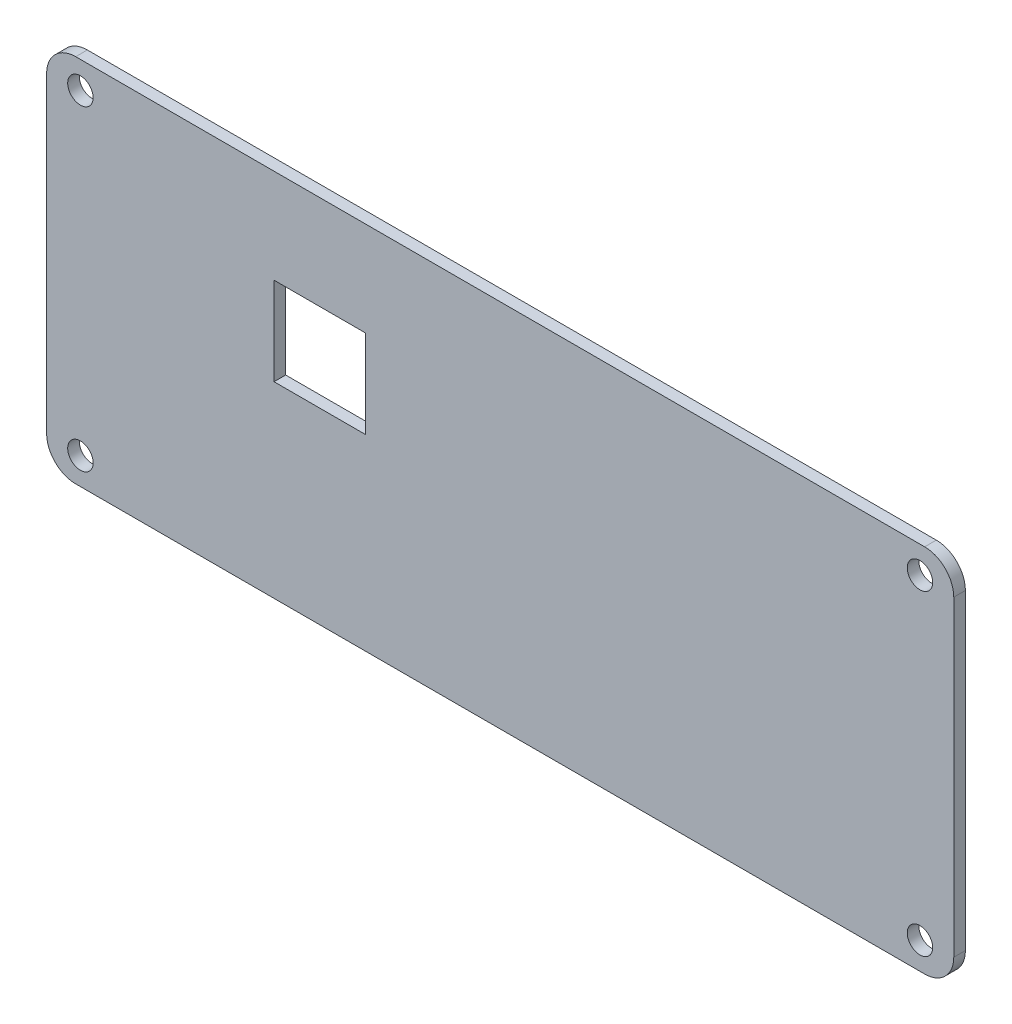
ISO-10303-21;
HEADER;
FILE_DESCRIPTION(('STEP AP214'),'2;1');
FILE_NAME('part.step','',(''),(''),'','','');
FILE_SCHEMA(('AUTOMOTIVE_DESIGN { 1 0 10303 214 1 1 1 1 }'));
ENDSEC;
DATA;
#1=APPLICATION_CONTEXT('core data for automotive mechanical design processes');
#2=APPLICATION_PROTOCOL_DEFINITION('international standard','automotive_design',2000,#1);
#3=PRODUCT_CONTEXT('',#1,'mechanical');
#4=PRODUCT('Part','Part','',(#3));
#5=PRODUCT_RELATED_PRODUCT_CATEGORY('part','',(#4));
#6=PRODUCT_DEFINITION_FORMATION('','',#4);
#7=PRODUCT_DEFINITION_CONTEXT('part definition',#1,'design');
#8=PRODUCT_DEFINITION('design','',#6,#7);
#9=PRODUCT_DEFINITION_SHAPE('','',#8);
#10=(LENGTH_UNIT() NAMED_UNIT(*) SI_UNIT(.MILLI.,.METRE.));
#11=(NAMED_UNIT(*) PLANE_ANGLE_UNIT() SI_UNIT($,.RADIAN.));
#12=(NAMED_UNIT(*) SI_UNIT($,.STERADIAN.) SOLID_ANGLE_UNIT());
#13=UNCERTAINTY_MEASURE_WITH_UNIT(LENGTH_MEASURE(1.E-05),#10,'distance_accuracy_value','');
#14=(GEOMETRIC_REPRESENTATION_CONTEXT(3) GLOBAL_UNCERTAINTY_ASSIGNED_CONTEXT((#13)) GLOBAL_UNIT_ASSIGNED_CONTEXT((#10,
#11,#12)) REPRESENTATION_CONTEXT('',''));
#15=CARTESIAN_POINT('',(0.,0.,0.));
#16=DIRECTION('',(0.,0.,1.));
#17=DIRECTION('',(1.,0.,0.));
#18=AXIS2_PLACEMENT_3D('',#15,#16,#17);
#19=CARTESIAN_POINT('',(4.65,-3.7,0.));
#20=DIRECTION('',(0.,0.,-1.));
#21=DIRECTION('',(1.,0.,0.));
#22=AXIS2_PLACEMENT_3D('',#19,#20,#21);
#23=CYLINDRICAL_SURFACE('',#22,1.75);
#24=CARTESIAN_POINT('',(4.65,-3.7,0.));
#25=DIRECTION('',(0.,0.,1.));
#26=DIRECTION('',(1.,0.,0.));
#27=AXIS2_PLACEMENT_3D('',#24,#25,#26);
#28=CIRCLE('',#27,1.75);
#29=CARTESIAN_POINT('',(6.4,-3.7,0.));
#30=VERTEX_POINT('',#29);
#31=EDGE_CURVE('E188',#30,#30,#28,.T.);
#32=ORIENTED_EDGE('',*,*,#31,.F.);
#33=DIRECTION('',(0.,0.,1.));
#34=VECTOR('',#33,1.);
#35=CARTESIAN_POINT('',(6.4,-3.7,0.));
#36=LINE('',#35,#34);
#37=CARTESIAN_POINT('',(6.4,-3.7,1.6));
#38=VERTEX_POINT('',#37);
#39=EDGE_CURVE('E10',#30,#38,#36,.T.);
#40=ORIENTED_EDGE('',*,*,#39,.T.);
#41=CARTESIAN_POINT('',(4.65,-3.7,1.6));
#42=DIRECTION('',(0.,0.,1.));
#43=DIRECTION('',(1.,0.,0.));
#44=AXIS2_PLACEMENT_3D('',#41,#42,#43);
#45=CIRCLE('',#44,1.75);
#46=EDGE_CURVE('E192',#38,#38,#45,.T.);
#47=ORIENTED_EDGE('',*,*,#46,.T.);
#48=ORIENTED_EDGE('',*,*,#39,.F.);
#49=EDGE_LOOP('',(#32,#40,#47,#48));
#50=FACE_BOUND('',#49,.T.);
#51=ADVANCED_FACE('F16',(#50),#23,.F.);
#52=CARTESIAN_POINT('',(31.285,-25.085,0.));
#53=DIRECTION('',(0.,1.,0.));
#54=DIRECTION('',(1.,0.,0.));
#55=AXIS2_PLACEMENT_3D('',#52,#53,#54);
#56=PLANE('',#55);
#57=DIRECTION('',(0.,0.,1.));
#58=VECTOR('',#57,1.);
#59=CARTESIAN_POINT('',(31.285,-25.085,0.));
#60=LINE('',#59,#58);
#61=CARTESIAN_POINT('',(31.285,-25.085,0.));
#62=VERTEX_POINT('',#61);
#63=CARTESIAN_POINT('',(31.285,-25.085,1.6));
#64=VERTEX_POINT('',#63);
#65=EDGE_CURVE('E26',#62,#64,#60,.T.);
#66=ORIENTED_EDGE('',*,*,#65,.T.);
#67=DIRECTION('',(1.,0.,0.));
#68=VECTOR('',#67,1.);
#69=CARTESIAN_POINT('',(31.285,-25.085,1.6));
#70=LINE('',#69,#68);
#71=CARTESIAN_POINT('',(43.885,-25.085,1.6));
#72=VERTEX_POINT('',#71);
#73=EDGE_CURVE('E240',#64,#72,#70,.T.);
#74=ORIENTED_EDGE('',*,*,#73,.T.);
#75=DIRECTION('',(0.,0.,1.));
#76=VECTOR('',#75,1.);
#77=CARTESIAN_POINT('',(43.885,-25.085,0.));
#78=LINE('',#77,#76);
#79=CARTESIAN_POINT('',(43.885,-25.085,0.));
#80=VERTEX_POINT('',#79);
#81=EDGE_CURVE('E221',#80,#72,#78,.T.);
#82=ORIENTED_EDGE('',*,*,#81,.F.);
#83=DIRECTION('',(1.,0.,0.));
#84=VECTOR('',#83,1.);
#85=CARTESIAN_POINT('',(31.285,-25.085,0.));
#86=LINE('',#85,#84);
#87=EDGE_CURVE('E209',#62,#80,#86,.T.);
#88=ORIENTED_EDGE('',*,*,#87,.F.);
#89=EDGE_LOOP('',(#66,#74,#82,#88));
#90=FACE_BOUND('',#89,.T.);
#91=ADVANCED_FACE('F376',(#90),#56,.T.);
#92=CARTESIAN_POINT('',(31.285,-12.985,0.));
#93=DIRECTION('',(1.,0.,0.));
#94=DIRECTION('',(0.,1.,0.));
#95=AXIS2_PLACEMENT_3D('',#92,#93,#94);
#96=PLANE('',#95);
#97=DIRECTION('',(0.,0.,1.));
#98=VECTOR('',#97,1.);
#99=CARTESIAN_POINT('',(31.285,-12.985,0.));
#100=LINE('',#99,#98);
#101=CARTESIAN_POINT('',(31.285,-12.985,0.));
#102=VERTEX_POINT('',#101);
#103=CARTESIAN_POINT('',(31.285,-12.985,1.6));
#104=VERTEX_POINT('',#103);
#105=EDGE_CURVE('E156',#102,#104,#100,.T.);
#106=ORIENTED_EDGE('',*,*,#105,.T.);
#107=DIRECTION('',(0.,-1.,0.));
#108=VECTOR('',#107,1.);
#109=CARTESIAN_POINT('',(31.285,-12.985,1.6));
#110=LINE('',#109,#108);
#111=EDGE_CURVE('E252',#104,#64,#110,.T.);
#112=ORIENTED_EDGE('',*,*,#111,.T.);
#113=ORIENTED_EDGE('',*,*,#65,.F.);
#114=DIRECTION('',(0.,-1.,0.));
#115=VECTOR('',#114,1.);
#116=CARTESIAN_POINT('',(31.285,-12.985,0.));
#117=LINE('',#116,#115);
#118=EDGE_CURVE('E213',#102,#62,#117,.T.);
#119=ORIENTED_EDGE('',*,*,#118,.F.);
#120=EDGE_LOOP('',(#106,#112,#113,#119));
#121=FACE_BOUND('',#120,.T.);
#122=ADVANCED_FACE('F387',(#121),#96,.T.);
#123=CARTESIAN_POINT('',(43.885,-25.085,0.));
#124=DIRECTION('',(-1.,0.,0.));
#125=DIRECTION('',(0.,0.,1.));
#126=AXIS2_PLACEMENT_3D('',#123,#124,#125);
#127=PLANE('',#126);
#128=ORIENTED_EDGE('',*,*,#81,.T.);
#129=DIRECTION('',(0.,1.,0.));
#130=VECTOR('',#129,1.);
#131=CARTESIAN_POINT('',(43.885,-25.085,1.6));
#132=LINE('',#131,#130);
#133=CARTESIAN_POINT('',(43.885,-12.985,1.6));
#134=VERTEX_POINT('',#133);
#135=EDGE_CURVE('E222',#72,#134,#132,.T.);
#136=ORIENTED_EDGE('',*,*,#135,.T.);
#137=DIRECTION('',(0.,0.,1.));
#138=VECTOR('',#137,1.);
#139=CARTESIAN_POINT('',(43.885,-12.985,0.));
#140=LINE('',#139,#138);
#141=CARTESIAN_POINT('',(43.885,-12.985,0.));
#142=VERTEX_POINT('',#141);
#143=EDGE_CURVE('E150',#142,#134,#140,.T.);
#144=ORIENTED_EDGE('',*,*,#143,.F.);
#145=DIRECTION('',(0.,1.,0.));
#146=VECTOR('',#145,1.);
#147=CARTESIAN_POINT('',(43.885,-25.085,0.));
#148=LINE('',#147,#146);
#149=EDGE_CURVE('E197',#80,#142,#148,.T.);
#150=ORIENTED_EDGE('',*,*,#149,.F.);
#151=EDGE_LOOP('',(#128,#136,#144,#150));
#152=FACE_BOUND('',#151,.T.);
#153=ADVANCED_FACE('F382',(#152),#127,.T.);
#154=CARTESIAN_POINT('',(43.885,-12.985,0.));
#155=DIRECTION('',(0.,-1.,0.));
#156=DIRECTION('',(0.,0.,-1.));
#157=AXIS2_PLACEMENT_3D('',#154,#155,#156);
#158=PLANE('',#157);
#159=ORIENTED_EDGE('',*,*,#143,.T.);
#160=DIRECTION('',(-1.,0.,0.));
#161=VECTOR('',#160,1.);
#162=CARTESIAN_POINT('',(43.885,-12.985,1.6));
#163=LINE('',#162,#161);
#164=EDGE_CURVE('E226',#134,#104,#163,.T.);
#165=ORIENTED_EDGE('',*,*,#164,.T.);
#166=ORIENTED_EDGE('',*,*,#105,.F.);
#167=DIRECTION('',(-1.,0.,0.));
#168=VECTOR('',#167,1.);
#169=CARTESIAN_POINT('',(43.885,-12.985,0.));
#170=LINE('',#169,#168);
#171=EDGE_CURVE('E193',#142,#102,#170,.T.);
#172=ORIENTED_EDGE('',*,*,#171,.F.);
#173=EDGE_LOOP('',(#159,#165,#166,#172));
#174=FACE_BOUND('',#173,.T.);
#175=ADVANCED_FACE('F392',(#174),#158,.T.);
#176=CARTESIAN_POINT('',(4.65,-47.2,0.));
#177=DIRECTION('',(0.,0.,-1.));
#178=DIRECTION('',(1.,0.,0.));
#179=AXIS2_PLACEMENT_3D('',#176,#177,#178);
#180=CYLINDRICAL_SURFACE('',#179,1.75);
#181=CARTESIAN_POINT('',(4.65,-47.2,0.));
#182=DIRECTION('',(0.,0.,1.));
#183=DIRECTION('',(1.,0.,0.));
#184=AXIS2_PLACEMENT_3D('',#181,#182,#183);
#185=CIRCLE('',#184,1.75);
#186=CARTESIAN_POINT('',(6.4,-47.2,0.));
#187=VERTEX_POINT('',#186);
#188=EDGE_CURVE('E148',#187,#187,#185,.T.);
#189=ORIENTED_EDGE('',*,*,#188,.F.);
#190=DIRECTION('',(0.,0.,1.));
#191=VECTOR('',#190,1.);
#192=CARTESIAN_POINT('',(6.4,-47.2,0.));
#193=LINE('',#192,#191);
#194=CARTESIAN_POINT('',(6.4,-47.2,1.6));
#195=VERTEX_POINT('',#194);
#196=EDGE_CURVE('E143',#187,#195,#193,.T.);
#197=ORIENTED_EDGE('',*,*,#196,.T.);
#198=CARTESIAN_POINT('',(4.65,-47.2,1.6));
#199=DIRECTION('',(0.,0.,1.));
#200=DIRECTION('',(1.,0.,0.));
#201=AXIS2_PLACEMENT_3D('',#198,#199,#200);
#202=CIRCLE('',#201,1.75);
#203=EDGE_CURVE('E146',#195,#195,#202,.T.);
#204=ORIENTED_EDGE('',*,*,#203,.T.);
#205=ORIENTED_EDGE('',*,*,#196,.F.);
#206=EDGE_LOOP('',(#189,#197,#204,#205));
#207=FACE_BOUND('',#206,.T.);
#208=ADVANCED_FACE('F144',(#207),#180,.F.);
#209=CARTESIAN_POINT('',(120.15,-47.2,0.));
#210=DIRECTION('',(0.,0.,-1.));
#211=DIRECTION('',(1.,0.,0.));
#212=AXIS2_PLACEMENT_3D('',#209,#210,#211);
#213=CYLINDRICAL_SURFACE('',#212,1.75);
#214=CARTESIAN_POINT('',(120.15,-47.2,0.));
#215=DIRECTION('',(0.,0.,1.));
#216=DIRECTION('',(1.,0.,0.));
#217=AXIS2_PLACEMENT_3D('',#214,#215,#216);
#218=CIRCLE('',#217,1.75);
#219=CARTESIAN_POINT('',(121.9,-47.2,0.));
#220=VERTEX_POINT('',#219);
#221=EDGE_CURVE('E241',#220,#220,#218,.T.);
#222=ORIENTED_EDGE('',*,*,#221,.F.);
#223=DIRECTION('',(0.,0.,1.));
#224=VECTOR('',#223,1.);
#225=CARTESIAN_POINT('',(121.9,-47.2,0.));
#226=LINE('',#225,#224);
#227=CARTESIAN_POINT('',(121.9,-47.2,1.6));
#228=VERTEX_POINT('',#227);
#229=EDGE_CURVE('E151',#220,#228,#226,.T.);
#230=ORIENTED_EDGE('',*,*,#229,.T.);
#231=CARTESIAN_POINT('',(120.15,-47.2,1.6));
#232=DIRECTION('',(0.,0.,1.));
#233=DIRECTION('',(1.,0.,0.));
#234=AXIS2_PLACEMENT_3D('',#231,#232,#233);
#235=CIRCLE('',#234,1.75);
#236=EDGE_CURVE('E191',#228,#228,#235,.T.);
#237=ORIENTED_EDGE('',*,*,#236,.T.);
#238=ORIENTED_EDGE('',*,*,#229,.F.);
#239=EDGE_LOOP('',(#222,#230,#237,#238));
#240=FACE_BOUND('',#239,.T.);
#241=ADVANCED_FACE('F359',(#240),#213,.F.);
#242=CARTESIAN_POINT('',(120.15,-3.7,0.));
#243=DIRECTION('',(0.,0.,-1.));
#244=DIRECTION('',(1.,0.,0.));
#245=AXIS2_PLACEMENT_3D('',#242,#243,#244);
#246=CYLINDRICAL_SURFACE('',#245,1.75);
#247=CARTESIAN_POINT('',(120.15,-3.7,0.));
#248=DIRECTION('',(0.,0.,1.));
#249=DIRECTION('',(1.,0.,0.));
#250=AXIS2_PLACEMENT_3D('',#247,#248,#249);
#251=CIRCLE('',#250,1.75);
#252=CARTESIAN_POINT('',(121.9,-3.7,0.));
#253=VERTEX_POINT('',#252);
#254=EDGE_CURVE('E167',#253,#253,#251,.T.);
#255=ORIENTED_EDGE('',*,*,#254,.F.);
#256=DIRECTION('',(0.,0.,1.));
#257=VECTOR('',#256,1.);
#258=CARTESIAN_POINT('',(121.9,-3.7,0.));
#259=LINE('',#258,#257);
#260=CARTESIAN_POINT('',(121.9,-3.7,1.6));
#261=VERTEX_POINT('',#260);
#262=EDGE_CURVE('E40',#253,#261,#259,.T.);
#263=ORIENTED_EDGE('',*,*,#262,.T.);
#264=CARTESIAN_POINT('',(120.15,-3.7,1.6));
#265=DIRECTION('',(0.,0.,1.));
#266=DIRECTION('',(1.,0.,0.));
#267=AXIS2_PLACEMENT_3D('',#264,#265,#266);
#268=CIRCLE('',#267,1.75);
#269=EDGE_CURVE('E265',#261,#261,#268,.T.);
#270=ORIENTED_EDGE('',*,*,#269,.T.);
#271=ORIENTED_EDGE('',*,*,#262,.F.);
#272=EDGE_LOOP('',(#255,#263,#270,#271));
#273=FACE_BOUND('',#272,.T.);
#274=ADVANCED_FACE('F345',(#273),#246,.F.);
#275=CARTESIAN_POINT('',(120.8,-4.,0.));
#276=DIRECTION('',(0.,0.,-1.));
#277=DIRECTION('',(1.,0.,0.));
#278=AXIS2_PLACEMENT_3D('',#275,#276,#277);
#279=CYLINDRICAL_SURFACE('',#278,4.);
#280=CARTESIAN_POINT('',(120.8,-4.,0.));
#281=DIRECTION('',(0.,0.,1.));
#282=DIRECTION('',(1.,0.,0.));
#283=AXIS2_PLACEMENT_3D('',#280,#281,#282);
#284=CIRCLE('',#283,4.);
#285=CARTESIAN_POINT('',(124.8,-4.,0.));
#286=VERTEX_POINT('',#285);
#287=CARTESIAN_POINT('',(120.8,0.,0.));
#288=VERTEX_POINT('',#287);
#289=EDGE_CURVE('E202',#286,#288,#284,.T.);
#290=ORIENTED_EDGE('',*,*,#289,.T.);
#291=DIRECTION('',(0.,0.,1.));
#292=VECTOR('',#291,1.);
#293=CARTESIAN_POINT('',(120.8,0.,0.));
#294=LINE('',#293,#292);
#295=CARTESIAN_POINT('',(120.8,0.,1.6));
#296=VERTEX_POINT('',#295);
#297=EDGE_CURVE('E214',#288,#296,#294,.T.);
#298=ORIENTED_EDGE('',*,*,#297,.T.);
#299=CARTESIAN_POINT('',(120.8,-4.,1.6));
#300=DIRECTION('',(0.,0.,1.));
#301=DIRECTION('',(1.,0.,0.));
#302=AXIS2_PLACEMENT_3D('',#299,#300,#301);
#303=CIRCLE('',#302,4.);
#304=CARTESIAN_POINT('',(124.8,-4.,1.6));
#305=VERTEX_POINT('',#304);
#306=EDGE_CURVE('E173',#305,#296,#303,.T.);
#307=ORIENTED_EDGE('',*,*,#306,.F.);
#308=DIRECTION('',(0.,0.,1.));
#309=VECTOR('',#308,1.);
#310=CARTESIAN_POINT('',(124.8,-4.,0.));
#311=LINE('',#310,#309);
#312=EDGE_CURVE('E217',#286,#305,#311,.T.);
#313=ORIENTED_EDGE('',*,*,#312,.F.);
#314=EDGE_LOOP('',(#290,#298,#307,#313));
#315=FACE_BOUND('',#314,.T.);
#316=ADVANCED_FACE('F416',(#315),#279,.T.);
#317=CARTESIAN_POINT('',(124.8,-46.9,0.));
#318=DIRECTION('',(-1.,0.,0.));
#319=DIRECTION('',(0.,0.,1.));
#320=AXIS2_PLACEMENT_3D('',#317,#318,#319);
#321=PLANE('',#320);
#322=DIRECTION('',(0.,1.,0.));
#323=VECTOR('',#322,1.);
#324=CARTESIAN_POINT('',(124.8,-46.9,0.));
#325=LINE('',#324,#323);
#326=CARTESIAN_POINT('',(124.8,-46.9,0.));
#327=VERTEX_POINT('',#326);
#328=EDGE_CURVE('E168',#327,#286,#325,.T.);
#329=ORIENTED_EDGE('',*,*,#328,.T.);
#330=ORIENTED_EDGE('',*,*,#312,.T.);
#331=DIRECTION('',(0.,1.,0.));
#332=VECTOR('',#331,1.);
#333=CARTESIAN_POINT('',(124.8,-46.9,1.6));
#334=LINE('',#333,#332);
#335=CARTESIAN_POINT('',(124.8,-46.9,1.6));
#336=VERTEX_POINT('',#335);
#337=EDGE_CURVE('E169',#336,#305,#334,.T.);
#338=ORIENTED_EDGE('',*,*,#337,.F.);
#339=DIRECTION('',(0.,0.,1.));
#340=VECTOR('',#339,1.);
#341=CARTESIAN_POINT('',(124.8,-46.9,0.));
#342=LINE('',#341,#340);
#343=EDGE_CURVE('E218',#327,#336,#342,.T.);
#344=ORIENTED_EDGE('',*,*,#343,.F.);
#345=EDGE_LOOP('',(#329,#330,#338,#344));
#346=FACE_BOUND('',#345,.T.);
#347=ADVANCED_FACE('F471',(#346),#321,.F.);
#348=CARTESIAN_POINT('',(120.8,0.,0.));
#349=DIRECTION('',(0.,-1.,0.));
#350=DIRECTION('',(0.,0.,-1.));
#351=AXIS2_PLACEMENT_3D('',#348,#349,#350);
#352=PLANE('',#351);
#353=DIRECTION('',(-1.,0.,0.));
#354=VECTOR('',#353,1.);
#355=CARTESIAN_POINT('',(120.8,0.,0.));
#356=LINE('',#355,#354);
#357=CARTESIAN_POINT('',(4.,0.,0.));
#358=VERTEX_POINT('',#357);
#359=EDGE_CURVE('E198',#288,#358,#356,.T.);
#360=ORIENTED_EDGE('',*,*,#359,.T.);
#361=DIRECTION('',(0.,0.,1.));
#362=VECTOR('',#361,1.);
#363=CARTESIAN_POINT('',(4.,0.,0.));
#364=LINE('',#363,#362);
#365=CARTESIAN_POINT('',(4.,0.,1.6));
#366=VERTEX_POINT('',#365);
#367=EDGE_CURVE('E268',#358,#366,#364,.T.);
#368=ORIENTED_EDGE('',*,*,#367,.T.);
#369=DIRECTION('',(-1.,0.,0.));
#370=VECTOR('',#369,1.);
#371=CARTESIAN_POINT('',(120.8,0.,1.6));
#372=LINE('',#371,#370);
#373=EDGE_CURVE('E204',#296,#366,#372,.T.);
#374=ORIENTED_EDGE('',*,*,#373,.F.);
#375=ORIENTED_EDGE('',*,*,#297,.F.);
#376=EDGE_LOOP('',(#360,#368,#374,#375));
#377=FACE_BOUND('',#376,.T.);
#378=ADVANCED_FACE('F463',(#377),#352,.F.);
#379=CARTESIAN_POINT('',(120.8,-46.9,0.));
#380=DIRECTION('',(0.,0.,-1.));
#381=DIRECTION('',(1.,0.,0.));
#382=AXIS2_PLACEMENT_3D('',#379,#380,#381);
#383=CYLINDRICAL_SURFACE('',#382,4.);
#384=CARTESIAN_POINT('',(120.8,-46.9,0.));
#385=DIRECTION('',(0.,0.,1.));
#386=DIRECTION('',(1.,0.,0.));
#387=AXIS2_PLACEMENT_3D('',#384,#385,#386);
#388=CIRCLE('',#387,4.);
#389=CARTESIAN_POINT('',(120.8,-50.9,0.));
#390=VERTEX_POINT('',#389);
#391=EDGE_CURVE('E163',#390,#327,#388,.T.);
#392=ORIENTED_EDGE('',*,*,#391,.T.);
#393=ORIENTED_EDGE('',*,*,#343,.T.);
#394=CARTESIAN_POINT('',(120.8,-46.9,1.6));
#395=DIRECTION('',(0.,0.,1.));
#396=DIRECTION('',(1.,0.,0.));
#397=AXIS2_PLACEMENT_3D('',#394,#395,#396);
#398=CIRCLE('',#397,4.);
#399=CARTESIAN_POINT('',(120.8,-50.9,1.6));
#400=VERTEX_POINT('',#399);
#401=EDGE_CURVE('E174',#400,#336,#398,.T.);
#402=ORIENTED_EDGE('',*,*,#401,.F.);
#403=DIRECTION('',(0.,0.,1.));
#404=VECTOR('',#403,1.);
#405=CARTESIAN_POINT('',(120.8,-50.9,0.));
#406=LINE('',#405,#404);
#407=EDGE_CURVE('E175',#390,#400,#406,.T.);
#408=ORIENTED_EDGE('',*,*,#407,.F.);
#409=EDGE_LOOP('',(#392,#393,#402,#408));
#410=FACE_BOUND('',#409,.T.);
#411=ADVANCED_FACE('F454',(#410),#383,.T.);
#412=CARTESIAN_POINT('',(4.,-4.,0.));
#413=DIRECTION('',(0.,0.,-1.));
#414=DIRECTION('',(1.,0.,0.));
#415=AXIS2_PLACEMENT_3D('',#412,#413,#414);
#416=CYLINDRICAL_SURFACE('',#415,4.);
#417=CARTESIAN_POINT('',(4.,-4.,0.));
#418=DIRECTION('',(0.,0.,1.));
#419=DIRECTION('',(1.,0.,0.));
#420=AXIS2_PLACEMENT_3D('',#417,#418,#419);
#421=CIRCLE('',#420,4.);
#422=CARTESIAN_POINT('',(0.,-4.,0.));
#423=VERTEX_POINT('',#422);
#424=EDGE_CURVE('E203',#358,#423,#421,.T.);
#425=ORIENTED_EDGE('',*,*,#424,.T.);
#426=DIRECTION('',(0.,0.,1.));
#427=VECTOR('',#426,1.);
#428=CARTESIAN_POINT('',(0.,-4.,0.));
#429=LINE('',#428,#427);
#430=CARTESIAN_POINT('',(0.,-4.,1.6));
#431=VERTEX_POINT('',#430);
#432=EDGE_CURVE('E245',#423,#431,#429,.T.);
#433=ORIENTED_EDGE('',*,*,#432,.T.);
#434=CARTESIAN_POINT('',(4.,-4.,1.6));
#435=DIRECTION('',(0.,0.,1.));
#436=DIRECTION('',(1.,0.,0.));
#437=AXIS2_PLACEMENT_3D('',#434,#435,#436);
#438=CIRCLE('',#437,4.);
#439=EDGE_CURVE('E208',#366,#431,#438,.T.);
#440=ORIENTED_EDGE('',*,*,#439,.F.);
#441=ORIENTED_EDGE('',*,*,#367,.F.);
#442=EDGE_LOOP('',(#425,#433,#440,#441));
#443=FACE_BOUND('',#442,.T.);
#444=ADVANCED_FACE('F363',(#443),#416,.T.);
#445=CARTESIAN_POINT('',(62.399602953014,-25.45011024283,1.6));
#446=DIRECTION('',(0.,0.,1.));
#447=DIRECTION('',(1.,0.,0.));
#448=AXIS2_PLACEMENT_3D('',#445,#446,#447);
#449=PLANE('',#448);
#450=ORIENTED_EDGE('',*,*,#269,.F.);
#451=EDGE_LOOP('',(#450));
#452=FACE_BOUND('',#451,.T.);
#453=ORIENTED_EDGE('',*,*,#236,.F.);
#454=EDGE_LOOP('',(#453));
#455=FACE_BOUND('',#454,.T.);
#456=ORIENTED_EDGE('',*,*,#203,.F.);
#457=EDGE_LOOP('',(#456));
#458=FACE_BOUND('',#457,.T.);
#459=ORIENTED_EDGE('',*,*,#46,.F.);
#460=EDGE_LOOP('',(#459));
#461=FACE_BOUND('',#460,.T.);
#462=ORIENTED_EDGE('',*,*,#73,.F.);
#463=ORIENTED_EDGE('',*,*,#111,.F.);
#464=ORIENTED_EDGE('',*,*,#164,.F.);
#465=ORIENTED_EDGE('',*,*,#135,.F.);
#466=EDGE_LOOP('',(#462,#463,#464,#465));
#467=FACE_BOUND('',#466,.T.);
#468=CARTESIAN_POINT('',(4.,-46.9,1.6));
#469=DIRECTION('',(0.,0.,1.));
#470=DIRECTION('',(1.,0.,0.));
#471=AXIS2_PLACEMENT_3D('',#468,#469,#470);
#472=CIRCLE('',#471,4.001249804749);
#473=CARTESIAN_POINT('',(0.,-47.,1.6));
#474=VERTEX_POINT('',#473);
#475=CARTESIAN_POINT('',(4.1,-50.9,1.6));
#476=VERTEX_POINT('',#475);
#477=EDGE_CURVE('E19',#474,#476,#472,.T.);
#478=ORIENTED_EDGE('',*,*,#477,.T.);
#479=DIRECTION('',(1.,0.,0.));
#480=VECTOR('',#479,1.);
#481=CARTESIAN_POINT('',(4.1,-50.9,1.6));
#482=LINE('',#481,#480);
#483=EDGE_CURVE('E179',#476,#400,#482,.T.);
#484=ORIENTED_EDGE('',*,*,#483,.T.);
#485=ORIENTED_EDGE('',*,*,#401,.T.);
#486=ORIENTED_EDGE('',*,*,#337,.T.);
#487=ORIENTED_EDGE('',*,*,#306,.T.);
#488=ORIENTED_EDGE('',*,*,#373,.T.);
#489=ORIENTED_EDGE('',*,*,#439,.T.);
#490=DIRECTION('',(0.,-1.,0.));
#491=VECTOR('',#490,1.);
#492=CARTESIAN_POINT('',(0.,-4.,1.6));
#493=LINE('',#492,#491);
#494=EDGE_CURVE('E183',#431,#474,#493,.T.);
#495=ORIENTED_EDGE('',*,*,#494,.T.);
#496=EDGE_LOOP('',(#478,#484,#485,#486,#487,#488,#489,#495));
#497=FACE_BOUND('',#496,.T.);
#498=ADVANCED_FACE('F311',(#452,#455,#458,#461,#467,#497),#449,.T.);
#499=CARTESIAN_POINT('',(62.399602953014,-25.45011024283,0.));
#500=DIRECTION('',(0.,0.,1.));
#501=DIRECTION('',(1.,0.,0.));
#502=AXIS2_PLACEMENT_3D('',#499,#500,#501);
#503=PLANE('',#502);
#504=ORIENTED_EDGE('',*,*,#31,.T.);
#505=EDGE_LOOP('',(#504));
#506=FACE_BOUND('',#505,.T.);
#507=ORIENTED_EDGE('',*,*,#118,.T.);
#508=ORIENTED_EDGE('',*,*,#87,.T.);
#509=ORIENTED_EDGE('',*,*,#149,.T.);
#510=ORIENTED_EDGE('',*,*,#171,.T.);
#511=EDGE_LOOP('',(#507,#508,#509,#510));
#512=FACE_BOUND('',#511,.T.);
#513=ORIENTED_EDGE('',*,*,#188,.T.);
#514=EDGE_LOOP('',(#513));
#515=FACE_BOUND('',#514,.T.);
#516=ORIENTED_EDGE('',*,*,#221,.T.);
#517=EDGE_LOOP('',(#516));
#518=FACE_BOUND('',#517,.T.);
#519=ORIENTED_EDGE('',*,*,#254,.T.);
#520=EDGE_LOOP('',(#519));
#521=FACE_BOUND('',#520,.T.);
#522=DIRECTION('',(0.,-1.,0.));
#523=VECTOR('',#522,1.);
#524=CARTESIAN_POINT('',(0.,-4.,0.));
#525=LINE('',#524,#523);
#526=CARTESIAN_POINT('',(0.,-47.,0.));
#527=VERTEX_POINT('',#526);
#528=EDGE_CURVE('E180',#423,#527,#525,.T.);
#529=ORIENTED_EDGE('',*,*,#528,.F.);
#530=ORIENTED_EDGE('',*,*,#424,.F.);
#531=ORIENTED_EDGE('',*,*,#359,.F.);
#532=ORIENTED_EDGE('',*,*,#289,.F.);
#533=ORIENTED_EDGE('',*,*,#328,.F.);
#534=ORIENTED_EDGE('',*,*,#391,.F.);
#535=DIRECTION('',(1.,0.,0.));
#536=VECTOR('',#535,1.);
#537=CARTESIAN_POINT('',(4.1,-50.9,0.));
#538=LINE('',#537,#536);
#539=CARTESIAN_POINT('',(4.1,-50.9,0.));
#540=VERTEX_POINT('',#539);
#541=EDGE_CURVE('E160',#540,#390,#538,.T.);
#542=ORIENTED_EDGE('',*,*,#541,.F.);
#543=CARTESIAN_POINT('',(4.,-46.9,0.));
#544=DIRECTION('',(0.,0.,1.));
#545=DIRECTION('',(1.,0.,0.));
#546=AXIS2_PLACEMENT_3D('',#543,#544,#545);
#547=CIRCLE('',#546,4.001249804749);
#548=EDGE_CURVE('E237',#527,#540,#547,.T.);
#549=ORIENTED_EDGE('',*,*,#548,.F.);
#550=EDGE_LOOP('',(#529,#530,#531,#532,#533,#534,#542,#549));
#551=FACE_BOUND('',#550,.T.);
#552=ADVANCED_FACE('F302',(#506,#512,#515,#518,#521,#551),#503,.F.);
#553=CARTESIAN_POINT('',(4.1,-50.9,0.));
#554=DIRECTION('',(0.,1.,0.));
#555=DIRECTION('',(1.,0.,0.));
#556=AXIS2_PLACEMENT_3D('',#553,#554,#555);
#557=PLANE('',#556);
#558=ORIENTED_EDGE('',*,*,#541,.T.);
#559=ORIENTED_EDGE('',*,*,#407,.T.);
#560=ORIENTED_EDGE('',*,*,#483,.F.);
#561=DIRECTION('',(0.,0.,1.));
#562=VECTOR('',#561,1.);
#563=CARTESIAN_POINT('',(4.1,-50.9,0.));
#564=LINE('',#563,#562);
#565=EDGE_CURVE('E233',#540,#476,#564,.T.);
#566=ORIENTED_EDGE('',*,*,#565,.F.);
#567=EDGE_LOOP('',(#558,#559,#560,#566));
#568=FACE_BOUND('',#567,.T.);
#569=ADVANCED_FACE('F308',(#568),#557,.F.);
#570=CARTESIAN_POINT('',(0.,-4.,0.));
#571=DIRECTION('',(1.,0.,0.));
#572=DIRECTION('',(0.,1.,0.));
#573=AXIS2_PLACEMENT_3D('',#570,#571,#572);
#574=PLANE('',#573);
#575=ORIENTED_EDGE('',*,*,#528,.T.);
#576=DIRECTION('',(0.,0.,1.));
#577=VECTOR('',#576,1.);
#578=CARTESIAN_POINT('',(0.,-47.,0.));
#579=LINE('',#578,#577);
#580=EDGE_CURVE('E184',#527,#474,#579,.T.);
#581=ORIENTED_EDGE('',*,*,#580,.T.);
#582=ORIENTED_EDGE('',*,*,#494,.F.);
#583=ORIENTED_EDGE('',*,*,#432,.F.);
#584=EDGE_LOOP('',(#575,#581,#582,#583));
#585=FACE_BOUND('',#584,.T.);
#586=ADVANCED_FACE('F419',(#585),#574,.F.);
#587=CARTESIAN_POINT('',(4.,-46.9,0.));
#588=DIRECTION('',(0.,0.,-1.));
#589=DIRECTION('',(1.,0.,0.));
#590=AXIS2_PLACEMENT_3D('',#587,#588,#589);
#591=CYLINDRICAL_SURFACE('',#590,4.001249804749);
#592=ORIENTED_EDGE('',*,*,#548,.T.);
#593=ORIENTED_EDGE('',*,*,#565,.T.);
#594=ORIENTED_EDGE('',*,*,#477,.F.);
#595=ORIENTED_EDGE('',*,*,#580,.F.);
#596=EDGE_LOOP('',(#592,#593,#594,#595));
#597=FACE_BOUND('',#596,.T.);
#598=ADVANCED_FACE('F293',(#597),#591,.T.);
#599=CLOSED_SHELL('',(#51,#91,#122,#153,#175,#208,#241,#274,#316,#347,#378,#411,#444,#498,#552,
#569,#586,#598));
#600=MANIFOLD_SOLID_BREP('B1',#599);
#601=ADVANCED_BREP_SHAPE_REPRESENTATION('',(#18,#600),#14);
#602=SHAPE_DEFINITION_REPRESENTATION(#9,#601);
ENDSEC;
END-ISO-10303-21;
